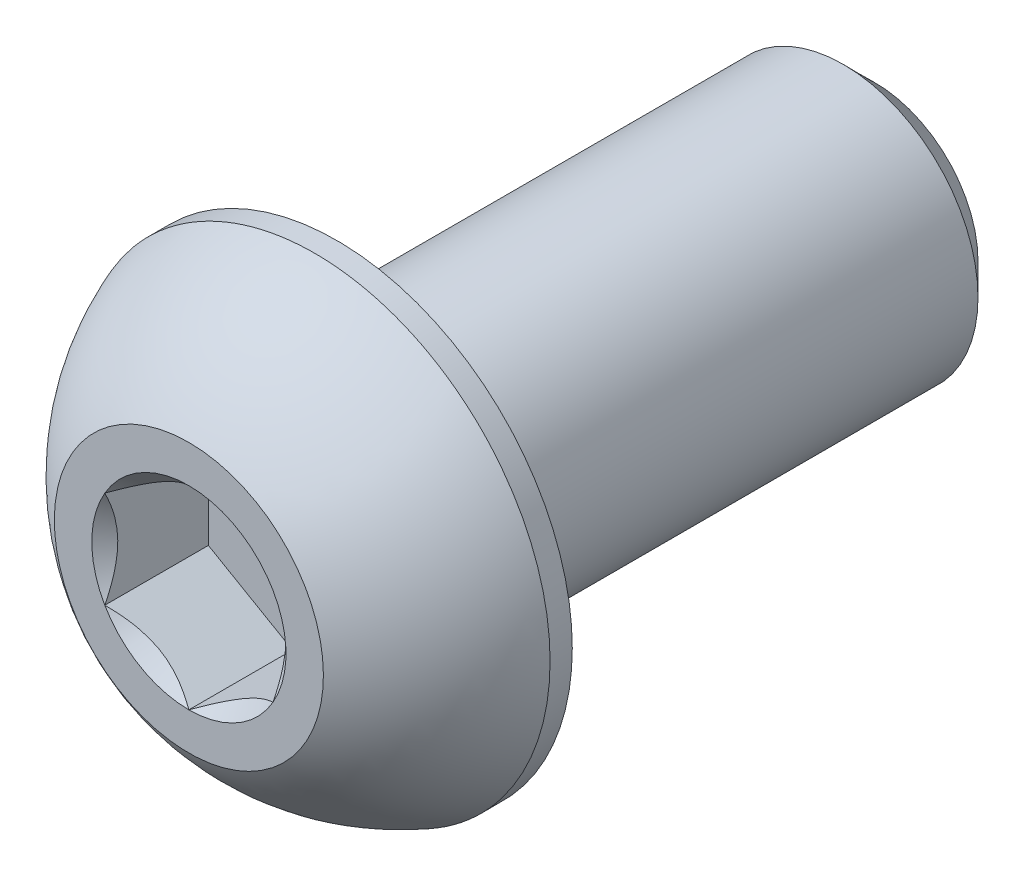
ISO-10303-21;
HEADER;
FILE_DESCRIPTION(('STEP AP214'),'2;1');
FILE_NAME('part.step','',(''),(''),'','','');
FILE_SCHEMA(('AUTOMOTIVE_DESIGN { 1 0 10303 214 1 1 1 1 }'));
ENDSEC;
DATA;
#1=APPLICATION_CONTEXT('core data for automotive mechanical design processes');
#2=APPLICATION_PROTOCOL_DEFINITION('international standard','automotive_design',2000,#1);
#3=PRODUCT_CONTEXT('',#1,'mechanical');
#4=PRODUCT('Part','Part','',(#3));
#5=PRODUCT_RELATED_PRODUCT_CATEGORY('part','',(#4));
#6=PRODUCT_DEFINITION_FORMATION('','',#4);
#7=PRODUCT_DEFINITION_CONTEXT('part definition',#1,'design');
#8=PRODUCT_DEFINITION('design','',#6,#7);
#9=PRODUCT_DEFINITION_SHAPE('','',#8);
#10=(LENGTH_UNIT() NAMED_UNIT(*) SI_UNIT(.MILLI.,.METRE.));
#11=(NAMED_UNIT(*) PLANE_ANGLE_UNIT() SI_UNIT($,.RADIAN.));
#12=(NAMED_UNIT(*) SI_UNIT($,.STERADIAN.) SOLID_ANGLE_UNIT());
#13=UNCERTAINTY_MEASURE_WITH_UNIT(LENGTH_MEASURE(1.E-05),#10,'distance_accuracy_value','');
#14=(GEOMETRIC_REPRESENTATION_CONTEXT(3) GLOBAL_UNCERTAINTY_ASSIGNED_CONTEXT((#13)) GLOBAL_UNIT_ASSIGNED_CONTEXT((#10,
#11,#12)) REPRESENTATION_CONTEXT('',''));
#15=CARTESIAN_POINT('',(0.,0.,0.));
#16=DIRECTION('',(0.,0.,1.));
#17=DIRECTION('',(1.,0.,0.));
#18=AXIS2_PLACEMENT_3D('',#15,#16,#17);
#19=CARTESIAN_POINT('',(2.5,-1.44337567297406,-3.08));
#20=DIRECTION('',(0.,0.,1.));
#21=DIRECTION('',(1.,0.,0.));
#22=AXIS2_PLACEMENT_3D('',#19,#20,#21);
#23=PLANE('',#22);
#24=DIRECTION('',(0.,1.,0.));
#25=VECTOR('',#24,1.);
#26=CARTESIAN_POINT('',(-2.5,1.44337567297406,-3.08));
#27=LINE('',#26,#25);
#28=CARTESIAN_POINT('',(-2.5,1.44337567297406,-3.08));
#29=VERTEX_POINT('',#28);
#30=CARTESIAN_POINT('',(-2.5,-1.44337567297407,-3.08));
#31=VERTEX_POINT('',#30);
#32=EDGE_CURVE('E67',#29,#31,#27,.F.);
#33=ORIENTED_EDGE('',*,*,#32,.T.);
#34=DIRECTION('',(0.866025403784439,-0.5,0.));
#35=VECTOR('',#34,1.);
#36=CARTESIAN_POINT('',(-2.5,-1.44337567297407,-3.08));
#37=LINE('',#36,#35);
#38=CARTESIAN_POINT('',(0.,-2.88675134594813,-3.08));
#39=VERTEX_POINT('',#38);
#40=EDGE_CURVE('E81',#31,#39,#37,.T.);
#41=ORIENTED_EDGE('',*,*,#40,.T.);
#42=DIRECTION('',(0.866025403784439,0.5,0.));
#43=VECTOR('',#42,1.);
#44=CARTESIAN_POINT('',(0.,-2.88675134594813,-3.08));
#45=LINE('',#44,#43);
#46=CARTESIAN_POINT('',(2.5,-1.44337567297407,-3.08));
#47=VERTEX_POINT('',#46);
#48=EDGE_CURVE('E84',#39,#47,#45,.T.);
#49=ORIENTED_EDGE('',*,*,#48,.T.);
#50=DIRECTION('',(0.,1.,0.));
#51=VECTOR('',#50,1.);
#52=CARTESIAN_POINT('',(2.5,-1.44337567297406,-3.08));
#53=LINE('',#52,#51);
#54=CARTESIAN_POINT('',(2.5,1.44337567297407,-3.08));
#55=VERTEX_POINT('',#54);
#56=EDGE_CURVE('E93',#47,#55,#53,.T.);
#57=ORIENTED_EDGE('',*,*,#56,.T.);
#58=DIRECTION('',(-0.866025403784439,0.5,0.));
#59=VECTOR('',#58,1.);
#60=CARTESIAN_POINT('',(2.5,1.44337567297407,-3.08));
#61=LINE('',#60,#59);
#62=CARTESIAN_POINT('',(0.,2.88675134594813,-3.08));
#63=VERTEX_POINT('',#62);
#64=EDGE_CURVE('E265',#55,#63,#61,.T.);
#65=ORIENTED_EDGE('',*,*,#64,.T.);
#66=DIRECTION('',(-0.866025403784438,-0.5,0.));
#67=VECTOR('',#66,1.);
#68=CARTESIAN_POINT('',(0.,2.88675134594813,-3.08));
#69=LINE('',#68,#67);
#70=EDGE_CURVE('E72',#63,#29,#69,.T.);
#71=ORIENTED_EDGE('',*,*,#70,.T.);
#72=EDGE_LOOP('',(#33,#41,#49,#57,#65,#71));
#73=FACE_BOUND('',#72,.T.);
#74=ADVANCED_FACE('F17',(#73),#23,.T.);
#75=CARTESIAN_POINT('',(-2.5,-1.44337567297407,-3.08));
#76=DIRECTION('',(-0.5,-0.866025403784439,0.));
#77=DIRECTION('',(0.866025403784439,-0.5,0.));
#78=AXIS2_PLACEMENT_3D('',#75,#76,#77);
#79=PLANE('',#78);
#80=CARTESIAN_POINT('',(-2.49999999998569,-1.44337567298233,-1.46396678585863E-11));
#81=CARTESIAN_POINT('',(-2.41407377904315,-1.49298519977395,-0.0495619175271006));
#82=CARTESIAN_POINT('',(-2.32671086992273,-1.54342419887182,-0.0962124995576485));
#83=CARTESIAN_POINT('',(-2.1485689328475,-1.64627449419617,-0.181627723729904));
#84=CARTESIAN_POINT('',(-2.05777297284226,-1.69869556614652,-0.220344856398487));
#85=CARTESIAN_POINT('',(-1.87468737311898,-1.8044000864315,-0.286667565165768));
#86=CARTESIAN_POINT('',(-1.78244433465153,-1.85765662952155,-0.314439795899311));
#87=CARTESIAN_POINT('',(-1.59592809137045,-1.96534183278812,-0.357228206963412));
#88=CARTESIAN_POINT('',(-1.5016605802636,-2.0197672057015,-0.372276315251622));
#89=CARTESIAN_POINT('',(-1.33918618210216,-2.11357184321643,-0.385853949513296));
#90=CARTESIAN_POINT('',(-1.27118904995568,-2.15283000576532,-0.387863271812533));
#91=CARTESIAN_POINT('',(-1.13530603994534,-2.23128209817308,-0.384473799764408));
#92=CARTESIAN_POINT('',(-1.0674202094257,-2.27047600069776,-0.379072408806146));
#93=CARTESIAN_POINT('',(-0.932289663221173,-2.34849365792468,-0.361168889112225));
#94=CARTESIAN_POINT('',(-0.865045749948768,-2.38731694935387,-0.348658821405654));
#95=CARTESIAN_POINT('',(-0.73172077243572,-2.46429216101073,-0.317224631812077));
#96=CARTESIAN_POINT('',(-0.665639619422681,-2.50244413249117,-0.298301001831163));
#97=CARTESIAN_POINT('',(-0.496416901916349,-2.60014491399645,-0.242135698828271));
#98=CARTESIAN_POINT('',(-0.394323538960074,-2.65908854458173,-0.200665028171538));
#99=CARTESIAN_POINT('',(-0.244203096433952,-2.74576062248505,-0.130658871896435));
#100=CARTESIAN_POINT('',(-0.194731548985054,-2.7743230337219,-0.106062244031806));
#101=CARTESIAN_POINT('',(-0.0967044691619815,-2.83091899464562,-0.0546271487293995));
#102=CARTESIAN_POINT('',(-0.0481483974597287,-2.85895285571371,-0.0277900552243485));
#103=CARTESIAN_POINT('',(-1.43136557881296E-11,-2.88675134593987,-1.46380702188117E-11));
#104=B_SPLINE_CURVE_WITH_KNOTS('',3,(#80,#81,#82,#83,#84,#85,#86,#87,#88,#89,#90,#91,#92,#93,
#94,#95,#96,#97,#98,#99,#100,#101,#102,#103),.UNSPECIFIED.,.F.,.F.,(4,2,2,2,2,2,2,2,2,2,2,4),
(0.,0.332957366447785,0.667853853657762,0.997433317025183,1.32618330924165,1.56147590693968,
1.79685096895087,2.03248941594701,2.26810979408197,2.64223182585016,2.82878537245759,
3.01522534654986),.UNSPECIFIED.);
#105=CARTESIAN_POINT('',(-2.49999999997815,-1.44337567296145,-3.16097570017431E-11));
#106=VERTEX_POINT('',#105);
#107=CARTESIAN_POINT('',(3.65479501188255E-11,-2.88675134591877,-3.57407377030047E-11));
#108=VERTEX_POINT('',#107);
#109=EDGE_CURVE('E20',#106,#108,#104,.T.);
#110=ORIENTED_EDGE('',*,*,#109,.T.);
#111=DIRECTION('',(0.,0.,1.));
#112=VECTOR('',#111,1.);
#113=CARTESIAN_POINT('',(0.,-2.88675134594813,-3.08));
#114=LINE('',#113,#112);
#115=EDGE_CURVE('E88',#108,#39,#114,.F.);
#116=ORIENTED_EDGE('',*,*,#115,.T.);
#117=ORIENTED_EDGE('',*,*,#40,.F.);
#118=DIRECTION('',(0.,0.,1.));
#119=VECTOR('',#118,1.);
#120=CARTESIAN_POINT('',(-2.5,-1.44337567297407,-3.08));
#121=LINE('',#120,#119);
#122=EDGE_CURVE('E59',#31,#106,#121,.T.);
#123=ORIENTED_EDGE('',*,*,#122,.T.);
#124=EDGE_LOOP('',(#110,#116,#117,#123));
#125=FACE_BOUND('',#124,.T.);
#126=ADVANCED_FACE('F89',(#125),#79,.F.);
#127=CARTESIAN_POINT('',(0.,-2.88675134594813,-3.08));
#128=DIRECTION('',(0.5,-0.866025403784439,0.));
#129=DIRECTION('',(0.866025403784439,0.5,0.));
#130=AXIS2_PLACEMENT_3D('',#127,#128,#129);
#131=PLANE('',#130);
#132=CARTESIAN_POINT('',(1.43122427161779E-11,-2.88675134593987,-1.46410621327117E-11));
#133=CARTESIAN_POINT('',(0.0859262209568495,-2.83714181914825,-0.0495619175271025));
#134=CARTESIAN_POINT('',(0.173289130077267,-2.78670282005038,-0.0962124995576506));
#135=CARTESIAN_POINT('',(0.351431067152504,-2.68385252472603,-0.181627723729906));
#136=CARTESIAN_POINT('',(0.442227027157743,-2.63143145277568,-0.22034485639849));
#137=CARTESIAN_POINT('',(0.625312626881024,-2.5257269324907,-0.28666756516577));
#138=CARTESIAN_POINT('',(0.717555665348469,-2.47247038940065,-0.314439795899313));
#139=CARTESIAN_POINT('',(0.904071908629556,-2.36478518613408,-0.357228206963415));
#140=CARTESIAN_POINT('',(0.998339419736406,-2.3103598132207,-0.372276315251625));
#141=CARTESIAN_POINT('',(1.16081381789785,-2.21655517570577,-0.385853949513299));
#142=CARTESIAN_POINT('',(1.22881095004432,-2.17729701315688,-0.387863271812536));
#143=CARTESIAN_POINT('',(1.36469396005466,-2.09884492074912,-0.384473799764411));
#144=CARTESIAN_POINT('',(1.43257979057431,-2.05965101822444,-0.379072408806149));
#145=CARTESIAN_POINT('',(1.56771033677883,-1.98163336099752,-0.361168889112229));
#146=CARTESIAN_POINT('',(1.63495425005123,-1.94281006956833,-0.348658821405657));
#147=CARTESIAN_POINT('',(1.76827922756428,-1.86583485791147,-0.317224631812081));
#148=CARTESIAN_POINT('',(1.83436038057732,-1.82768288643103,-0.298301001831167));
#149=CARTESIAN_POINT('',(2.00358309808365,-1.72998210492575,-0.242135698828275));
#150=CARTESIAN_POINT('',(2.10567646103993,-1.67103847434047,-0.200665028171542));
#151=CARTESIAN_POINT('',(2.25579690356605,-1.58436639643715,-0.130658871896439));
#152=CARTESIAN_POINT('',(2.30526845101495,-1.5558039852003,-0.10606224403181));
#153=CARTESIAN_POINT('',(2.40329553083802,-1.49920802427658,-0.0546271487294037));
#154=CARTESIAN_POINT('',(2.45185160254027,-1.47117416320849,-0.0277900552243527));
#155=CARTESIAN_POINT('',(2.49999999998569,-1.44337567298233,-1.46422604732884E-11));
#156=B_SPLINE_CURVE_WITH_KNOTS('',3,(#132,#133,#134,#135,#136,#137,#138,#139,#140,#141,#142,
#143,#144,#145,#146,#147,#148,#149,#150,#151,#152,#153,#154,#155),.UNSPECIFIED.,.F.,.F.,(4,2,2,
2,2,2,2,2,2,2,2,4),(0.,0.332957366447785,0.667853853657763,0.997433317025185,1.32618330924165,
1.56147590693968,1.79685096895087,2.03248941594701,2.26810979408197,2.64223182585016,
2.82878537245759,3.01522534654986),.UNSPECIFIED.);
#157=CARTESIAN_POINT('',(2.49999999999284,-1.44337567292773,-3.57428146410643E-11));
#158=VERTEX_POINT('',#157);
#159=EDGE_CURVE('E202',#108,#158,#156,.T.);
#160=ORIENTED_EDGE('',*,*,#159,.T.);
#161=DIRECTION('',(0.,0.,-1.));
#162=VECTOR('',#161,1.);
#163=CARTESIAN_POINT('',(2.5,-1.44337567297407,-3.08));
#164=LINE('',#163,#162);
#165=EDGE_CURVE('E97',#158,#47,#164,.T.);
#166=ORIENTED_EDGE('',*,*,#165,.T.);
#167=ORIENTED_EDGE('',*,*,#48,.F.);
#168=ORIENTED_EDGE('',*,*,#115,.F.);
#169=EDGE_LOOP('',(#160,#166,#167,#168));
#170=FACE_BOUND('',#169,.T.);
#171=ADVANCED_FACE('F95',(#170),#131,.F.);
#172=CARTESIAN_POINT('',(2.5,-1.44337567297406,-3.08));
#173=DIRECTION('',(1.,0.,0.));
#174=DIRECTION('',(0.,0.,-1.));
#175=AXIS2_PLACEMENT_3D('',#172,#173,#174);
#176=PLANE('',#175);
#177=CARTESIAN_POINT('',(2.5,-1.44337567295754,-1.46394821813904E-11));
#178=CARTESIAN_POINT('',(2.5,-1.3441566193743,-0.0495619175271012));
#179=CARTESIAN_POINT('',(2.5,-1.24327862117858,-0.0962124995576497));
#180=CARTESIAN_POINT('',(2.5,-1.03757803052988,-0.181627723729906));
#181=CARTESIAN_POINT('',(2.5,-0.932735886629165,-0.22034485639849));
#182=CARTESIAN_POINT('',(2.5,-0.721326846059205,-0.286667565165772));
#183=CARTESIAN_POINT('',(2.5,-0.614813759879106,-0.314439795899315));
#184=CARTESIAN_POINT('',(2.5,-0.399443353345959,-0.357228206963416));
#185=CARTESIAN_POINT('',(2.5,-0.290592607519207,-0.372276315251626));
#186=CARTESIAN_POINT('',(2.5,-0.102983332489348,-0.385853949513301));
#187=CARTESIAN_POINT('',(2.5,-0.024467007391568,-0.387863271812537));
#188=CARTESIAN_POINT('',(2.5,0.13243717742396,-0.384473799764412));
#189=CARTESIAN_POINT('',(2.5,0.210824982473321,-0.379072408806151));
#190=CARTESIAN_POINT('',(2.5,0.366860296927166,-0.36116888911223));
#191=CARTESIAN_POINT('',(2.5,0.444506879785539,-0.348658821405659));
#192=CARTESIAN_POINT('',(2.5,0.598457303099258,-0.317224631812082));
#193=CARTESIAN_POINT('',(2.5,0.674761246060135,-0.298301001831168));
#194=CARTESIAN_POINT('',(2.5,0.870162809070698,-0.242135698828276));
#195=CARTESIAN_POINT('',(2.5,0.988050070241258,-0.200665028171543));
#196=CARTESIAN_POINT('',(2.5,1.1613942260479,-0.130658871896439));
#197=CARTESIAN_POINT('',(2.5,1.2185190485216,-0.106062244031809));
#198=CARTESIAN_POINT('',(2.5,1.33171097036905,-0.0546271487294019));
#199=CARTESIAN_POINT('',(2.5,1.38777869250522,-0.0277900552243506));
#200=CARTESIAN_POINT('',(2.5,1.44337567295754,-1.46396590333616E-11));
#201=B_SPLINE_CURVE_WITH_KNOTS('',3,(#177,#178,#179,#180,#181,#182,#183,#184,#185,#186,#187,
#188,#189,#190,#191,#192,#193,#194,#195,#196,#197,#198,#199,#200),.UNSPECIFIED.,.F.,.F.,(4,2,2,
2,2,2,2,2,2,2,2,4),(0.,0.332957366447787,0.667853853657767,0.99743331702519,1.32618330924165,
1.56147590693969,1.79685096895088,2.03248941594702,2.26810979408198,2.64223182585017,
2.8287853724576,3.01522534654987),.UNSPECIFIED.);
#202=CARTESIAN_POINT('',(2.49999999995629,1.44337567299104,-3.57415206411453E-11));
#203=VERTEX_POINT('',#202);
#204=EDGE_CURVE('E184',#158,#203,#201,.T.);
#205=ORIENTED_EDGE('',*,*,#204,.T.);
#206=DIRECTION('',(0.,0.,1.));
#207=VECTOR('',#206,1.);
#208=CARTESIAN_POINT('',(2.5,1.44337567297407,-3.08));
#209=LINE('',#208,#207);
#210=EDGE_CURVE('E262',#203,#55,#209,.F.);
#211=ORIENTED_EDGE('',*,*,#210,.T.);
#212=ORIENTED_EDGE('',*,*,#56,.F.);
#213=ORIENTED_EDGE('',*,*,#165,.F.);
#214=EDGE_LOOP('',(#205,#211,#212,#213));
#215=FACE_BOUND('',#214,.T.);
#216=ADVANCED_FACE('F174',(#215),#176,.F.);
#217=CARTESIAN_POINT('',(2.5,1.44337567297407,-3.08));
#218=DIRECTION('',(0.5,0.866025403784439,0.));
#219=DIRECTION('',(-0.866025403784439,0.5,0.));
#220=AXIS2_PLACEMENT_3D('',#217,#218,#219);
#221=PLANE('',#220);
#222=CARTESIAN_POINT('',(2.49999999998569,1.44337567298233,-1.46397690507891E-11));
#223=CARTESIAN_POINT('',(2.41407377904315,1.49298519977395,-0.0495619175271006));
#224=CARTESIAN_POINT('',(2.32671086992273,1.54342419887182,-0.0962124995576485));
#225=CARTESIAN_POINT('',(2.1485689328475,1.64627449419617,-0.181627723729904));
#226=CARTESIAN_POINT('',(2.05777297284226,1.69869556614652,-0.220344856398487));
#227=CARTESIAN_POINT('',(1.87468737311898,1.8044000864315,-0.286667565165768));
#228=CARTESIAN_POINT('',(1.78244433465153,1.85765662952155,-0.314439795899311));
#229=CARTESIAN_POINT('',(1.59592809137045,1.96534183278812,-0.357228206963412));
#230=CARTESIAN_POINT('',(1.5016605802636,2.0197672057015,-0.372276315251622));
#231=CARTESIAN_POINT('',(1.33918618210216,2.11357184321643,-0.385853949513296));
#232=CARTESIAN_POINT('',(1.27118904995568,2.15283000576532,-0.387863271812533));
#233=CARTESIAN_POINT('',(1.13530603994534,2.23128209817308,-0.384473799764408));
#234=CARTESIAN_POINT('',(1.0674202094257,2.27047600069776,-0.379072408806146));
#235=CARTESIAN_POINT('',(0.932289663221173,2.34849365792468,-0.361168889112225));
#236=CARTESIAN_POINT('',(0.865045749948768,2.38731694935387,-0.348658821405654));
#237=CARTESIAN_POINT('',(0.73172077243572,2.46429216101073,-0.317224631812077));
#238=CARTESIAN_POINT('',(0.665639619422681,2.50244413249117,-0.298301001831163));
#239=CARTESIAN_POINT('',(0.496416901916349,2.60014491399645,-0.242135698828271));
#240=CARTESIAN_POINT('',(0.394323538960074,2.65908854458173,-0.200665028171538));
#241=CARTESIAN_POINT('',(0.244203096433952,2.74576062248505,-0.130658871896435));
#242=CARTESIAN_POINT('',(0.194731548985054,2.7743230337219,-0.106062244031806));
#243=CARTESIAN_POINT('',(0.0967044691619814,2.83091899464562,-0.0546271487293996));
#244=CARTESIAN_POINT('',(0.0481483974597285,2.85895285571371,-0.0277900552243486));
#245=CARTESIAN_POINT('',(1.4313665004019E-11,2.88675134593987,-1.4638073215738E-11));
#246=B_SPLINE_CURVE_WITH_KNOTS('',3,(#222,#223,#224,#225,#226,#227,#228,#229,#230,#231,#232,
#233,#234,#235,#236,#237,#238,#239,#240,#241,#242,#243,#244,#245),.UNSPECIFIED.,.F.,.F.,(4,2,2,
2,2,2,2,2,2,2,2,4),(0.,0.332957366447785,0.667853853657762,0.997433317025183,1.32618330924165,
1.56147590693968,1.79685096895087,2.03248941594701,2.26810979408197,2.64223182585016,
2.82878537245759,3.01522534654986),.UNSPECIFIED.);
#247=CARTESIAN_POINT('',(-3.65478449523691E-11,2.88675134591877,-3.57408260437138E-11));
#248=VERTEX_POINT('',#247);
#249=EDGE_CURVE('E178',#203,#248,#246,.T.);
#250=ORIENTED_EDGE('',*,*,#249,.T.);
#251=DIRECTION('',(0.,0.,1.));
#252=VECTOR('',#251,1.);
#253=CARTESIAN_POINT('',(0.,2.88675134594813,-3.08));
#254=LINE('',#253,#252);
#255=EDGE_CURVE('E257',#248,#63,#254,.F.);
#256=ORIENTED_EDGE('',*,*,#255,.T.);
#257=ORIENTED_EDGE('',*,*,#64,.F.);
#258=ORIENTED_EDGE('',*,*,#210,.F.);
#259=EDGE_LOOP('',(#250,#256,#257,#258));
#260=FACE_BOUND('',#259,.T.);
#261=ADVANCED_FACE('F170',(#260),#221,.F.);
#262=CARTESIAN_POINT('',(0.,2.88675134594813,-3.08));
#263=DIRECTION('',(-0.5,0.866025403784438,0.));
#264=DIRECTION('',(-0.866025403784438,-0.5,0.));
#265=AXIS2_PLACEMENT_3D('',#262,#263,#264);
#266=PLANE('',#265);
#267=CARTESIAN_POINT('',(-1.43122453357427E-11,2.88675134593987,-1.46408888183632E-11));
#268=CARTESIAN_POINT('',(-0.0859262209568495,2.83714181914825,-0.0495619175271024));
#269=CARTESIAN_POINT('',(-0.173289130077268,2.78670282005038,-0.0962124995576508));
#270=CARTESIAN_POINT('',(-0.351431067152505,2.68385252472603,-0.181627723729907));
#271=CARTESIAN_POINT('',(-0.442227027157744,2.63143145277568,-0.22034485639849));
#272=CARTESIAN_POINT('',(-0.625312626881025,2.5257269324907,-0.286667565165771));
#273=CARTESIAN_POINT('',(-0.717555665348471,2.47247038940065,-0.314439795899315));
#274=CARTESIAN_POINT('',(-0.904071908629558,2.36478518613408,-0.357228206963416));
#275=CARTESIAN_POINT('',(-0.998339419736408,2.3103598132207,-0.372276315251626));
#276=CARTESIAN_POINT('',(-1.16081381789785,2.21655517570577,-0.3858539495133));
#277=CARTESIAN_POINT('',(-1.22881095004432,2.17729701315688,-0.387863271812537));
#278=CARTESIAN_POINT('',(-1.36469396005466,2.09884492074912,-0.384473799764412));
#279=CARTESIAN_POINT('',(-1.43257979057431,2.05965101822444,-0.37907240880615));
#280=CARTESIAN_POINT('',(-1.56771033677883,1.98163336099751,-0.361168889112229));
#281=CARTESIAN_POINT('',(-1.63495425005123,1.94281006956833,-0.348658821405658));
#282=CARTESIAN_POINT('',(-1.76827922756428,1.86583485791147,-0.317224631812081));
#283=CARTESIAN_POINT('',(-1.83436038057732,1.82768288643103,-0.298301001831167));
#284=CARTESIAN_POINT('',(-2.00358309808365,1.72998210492575,-0.242135698828275));
#285=CARTESIAN_POINT('',(-2.10567646103993,1.67103847434047,-0.200665028171542));
#286=CARTESIAN_POINT('',(-2.25579690356605,1.58436639643715,-0.130658871896438));
#287=CARTESIAN_POINT('',(-2.30526845101495,1.5558039852003,-0.10606224403181));
#288=CARTESIAN_POINT('',(-2.40329553083802,1.49920802427657,-0.0546271487294029));
#289=CARTESIAN_POINT('',(-2.45185160254028,1.47117416320849,-0.0277900552243518));
#290=CARTESIAN_POINT('',(-2.49999999998569,1.44337567298233,-1.46406987167254E-11));
#291=B_SPLINE_CURVE_WITH_KNOTS('',3,(#267,#268,#269,#270,#271,#272,#273,#274,#275,#276,#277,
#278,#279,#280,#281,#282,#283,#284,#285,#286,#287,#288,#289,#290),.UNSPECIFIED.,.F.,.F.,(4,2,2,
2,2,2,2,2,2,2,2,4),(0.,0.332957366447787,0.667853853657765,0.997433317025187,1.32618330924165,
1.56147590693969,1.79685096895088,2.03248941594702,2.26810979408198,2.64223182585016,
2.82878537245759,3.01522534654986),.UNSPECIFIED.);
#292=CARTESIAN_POINT('',(-2.49999999999285,1.44337567292773,-3.57423066969592E-11));
#293=VERTEX_POINT('',#292);
#294=EDGE_CURVE('E40',#248,#293,#291,.T.);
#295=ORIENTED_EDGE('',*,*,#294,.T.);
#296=DIRECTION('',(0.,0.,1.));
#297=VECTOR('',#296,1.);
#298=CARTESIAN_POINT('',(-2.5,1.44337567297406,-3.08));
#299=LINE('',#298,#297);
#300=EDGE_CURVE('E250',#293,#29,#299,.F.);
#301=ORIENTED_EDGE('',*,*,#300,.T.);
#302=ORIENTED_EDGE('',*,*,#70,.F.);
#303=ORIENTED_EDGE('',*,*,#255,.F.);
#304=EDGE_LOOP('',(#295,#301,#302,#303));
#305=FACE_BOUND('',#304,.T.);
#306=ADVANCED_FACE('F163',(#305),#266,.F.);
#307=CARTESIAN_POINT('',(-2.5,1.44337567297406,-3.08));
#308=DIRECTION('',(-1.,0.,0.));
#309=DIRECTION('',(0.,0.,1.));
#310=AXIS2_PLACEMENT_3D('',#307,#308,#309);
#311=PLANE('',#310);
#312=CARTESIAN_POINT('',(-2.5,1.44337567295754,-1.46434148138432E-11));
#313=CARTESIAN_POINT('',(-2.5,1.34415661937429,-0.0495619175271046));
#314=CARTESIAN_POINT('',(-2.5,1.24327862117857,-0.0962124995576525));
#315=CARTESIAN_POINT('',(-2.5,1.03757803052987,-0.181627723729908));
#316=CARTESIAN_POINT('',(-2.5,0.932735886629161,-0.220344856398491));
#317=CARTESIAN_POINT('',(-2.5,0.721326846059201,-0.286667565165772));
#318=CARTESIAN_POINT('',(-2.5,0.614813759879103,-0.314439795899315));
#319=CARTESIAN_POINT('',(-2.5,0.399443353345957,-0.357228206963417));
#320=CARTESIAN_POINT('',(-2.5,0.290592607519206,-0.372276315251626));
#321=CARTESIAN_POINT('',(-2.5,0.102983332489346,-0.385853949513301));
#322=CARTESIAN_POINT('',(-2.5,0.0244670073915668,-0.387863271812537));
#323=CARTESIAN_POINT('',(-2.5,-0.132437177423961,-0.384473799764412));
#324=CARTESIAN_POINT('',(-2.5,-0.210824982473323,-0.379072408806151));
#325=CARTESIAN_POINT('',(-2.5,-0.366860296927167,-0.36116888911223));
#326=CARTESIAN_POINT('',(-2.5,-0.44450687978554,-0.348658821405659));
#327=CARTESIAN_POINT('',(-2.5,-0.598457303099258,-0.317224631812082));
#328=CARTESIAN_POINT('',(-2.5,-0.674761246060136,-0.298301001831168));
#329=CARTESIAN_POINT('',(-2.5,-0.870162809070698,-0.242135698828276));
#330=CARTESIAN_POINT('',(-2.5,-0.988050070241258,-0.200665028171542));
#331=CARTESIAN_POINT('',(-2.5,-1.1613942260479,-0.130658871896439));
#332=CARTESIAN_POINT('',(-2.5,-1.2185190485216,-0.10606224403181));
#333=CARTESIAN_POINT('',(-2.5,-1.33171097036905,-0.0546271487294023));
#334=CARTESIAN_POINT('',(-2.5,-1.38777869250522,-0.0277900552243509));
#335=CARTESIAN_POINT('',(-2.5,-1.44337567295754,-1.46396656675119E-11));
#336=B_SPLINE_CURVE_WITH_KNOTS('',3,(#312,#313,#314,#315,#316,#317,#318,#319,#320,#321,#322,
#323,#324,#325,#326,#327,#328,#329,#330,#331,#332,#333,#334,#335),.UNSPECIFIED.,.F.,.F.,(4,2,2,
2,2,2,2,2,2,2,2,4),(0.,0.332957366447785,0.667853853657762,0.997433317025184,1.32618330924165,
1.56147590693968,1.79685096895087,2.03248941594701,2.26810979408197,2.64223182585016,
2.82878537245759,3.01522534654986),.UNSPECIFIED.);
#337=EDGE_CURVE('E143',#293,#106,#336,.T.);
#338=ORIENTED_EDGE('',*,*,#337,.T.);
#339=ORIENTED_EDGE('',*,*,#122,.F.);
#340=ORIENTED_EDGE('',*,*,#32,.F.);
#341=ORIENTED_EDGE('',*,*,#300,.F.);
#342=EDGE_LOOP('',(#338,#339,#340,#341));
#343=FACE_BOUND('',#342,.T.);
#344=ADVANCED_FACE('F159',(#343),#311,.F.);
#345=CARTESIAN_POINT('',(0.,0.,-1.13686837721616E-10));
#346=DIRECTION('',(0.,0.,1.));
#347=DIRECTION('',(1.,0.,0.));
#348=AXIS2_PLACEMENT_3D('',#345,#346,#347);
#349=CONICAL_SURFACE('',#348,2.88675134584082,0.785398163397448);
#350=ORIENTED_EDGE('',*,*,#109,.F.);
#351=CARTESIAN_POINT('',(0.,0.,-5.6843418860808E-11));
#352=DIRECTION('',(0.,0.,1.));
#353=DIRECTION('',(1.,0.,0.));
#354=AXIS2_PLACEMENT_3D('',#351,#352,#353);
#355=CIRCLE('',#354,2.88675134589766);
#356=EDGE_CURVE('E151',#106,#108,#355,.T.);
#357=ORIENTED_EDGE('',*,*,#356,.T.);
#358=EDGE_LOOP('',(#350,#357));
#359=FACE_BOUND('',#358,.T.);
#360=ADVANCED_FACE('F162',(#359),#349,.F.);
#361=CARTESIAN_POINT('',(0.,0.,-1.13686837721616E-10));
#362=DIRECTION('',(0.,0.,1.));
#363=DIRECTION('',(1.,0.,0.));
#364=AXIS2_PLACEMENT_3D('',#361,#362,#363);
#365=CONICAL_SURFACE('',#364,2.88675134584082,0.785398163397448);
#366=ORIENTED_EDGE('',*,*,#159,.F.);
#367=CARTESIAN_POINT('',(0.,0.,-5.6843418860808E-11));
#368=DIRECTION('',(0.,0.,1.));
#369=DIRECTION('',(1.,0.,0.));
#370=AXIS2_PLACEMENT_3D('',#367,#368,#369);
#371=CIRCLE('',#370,2.88675134589766);
#372=EDGE_CURVE('E303',#108,#158,#371,.T.);
#373=ORIENTED_EDGE('',*,*,#372,.T.);
#374=EDGE_LOOP('',(#366,#373));
#375=FACE_BOUND('',#374,.T.);
#376=ADVANCED_FACE('F197',(#375),#365,.F.);
#377=CARTESIAN_POINT('',(0.,0.,-1.13686837721616E-10));
#378=DIRECTION('',(0.,0.,1.));
#379=DIRECTION('',(1.,0.,0.));
#380=AXIS2_PLACEMENT_3D('',#377,#378,#379);
#381=CONICAL_SURFACE('',#380,2.88675134584082,0.785398163397448);
#382=CARTESIAN_POINT('',(0.,0.,-5.6843418860808E-11));
#383=DIRECTION('',(0.,0.,1.));
#384=DIRECTION('',(1.,0.,0.));
#385=AXIS2_PLACEMENT_3D('',#382,#383,#384);
#386=CIRCLE('',#385,2.88675134589766);
#387=EDGE_CURVE('E304',#158,#203,#386,.T.);
#388=ORIENTED_EDGE('',*,*,#387,.T.);
#389=ORIENTED_EDGE('',*,*,#204,.F.);
#390=EDGE_LOOP('',(#388,#389));
#391=FACE_BOUND('',#390,.T.);
#392=ADVANCED_FACE('F193',(#391),#381,.F.);
#393=CARTESIAN_POINT('',(0.,0.,-1.13686837721616E-10));
#394=DIRECTION('',(0.,0.,1.));
#395=DIRECTION('',(1.,0.,0.));
#396=AXIS2_PLACEMENT_3D('',#393,#394,#395);
#397=CONICAL_SURFACE('',#396,2.88675134584082,0.785398163397448);
#398=ORIENTED_EDGE('',*,*,#249,.F.);
#399=CARTESIAN_POINT('',(0.,0.,-5.6843418860808E-11));
#400=DIRECTION('',(0.,0.,1.));
#401=DIRECTION('',(1.,0.,0.));
#402=AXIS2_PLACEMENT_3D('',#399,#400,#401);
#403=CIRCLE('',#402,2.88675134589766);
#404=EDGE_CURVE('E305',#203,#248,#403,.T.);
#405=ORIENTED_EDGE('',*,*,#404,.T.);
#406=EDGE_LOOP('',(#398,#405));
#407=FACE_BOUND('',#406,.T.);
#408=ADVANCED_FACE('F190',(#407),#397,.F.);
#409=CARTESIAN_POINT('',(0.,0.,-1.13686837721616E-10));
#410=DIRECTION('',(0.,0.,1.));
#411=DIRECTION('',(1.,0.,0.));
#412=AXIS2_PLACEMENT_3D('',#409,#410,#411);
#413=CONICAL_SURFACE('',#412,2.88675134584082,0.785398163397448);
#414=ORIENTED_EDGE('',*,*,#294,.F.);
#415=CARTESIAN_POINT('',(0.,0.,-5.6843852541677E-11));
#416=DIRECTION('',(0.,0.,1.));
#417=DIRECTION('',(1.,0.,0.));
#418=AXIS2_PLACEMENT_3D('',#415,#416,#417);
#419=CIRCLE('',#418,2.88675134589766);
#420=EDGE_CURVE('E298',#248,#293,#419,.T.);
#421=ORIENTED_EDGE('',*,*,#420,.T.);
#422=EDGE_LOOP('',(#414,#421));
#423=FACE_BOUND('',#422,.T.);
#424=ADVANCED_FACE('F138',(#423),#413,.F.);
#425=CARTESIAN_POINT('',(0.,0.,-1.13686837721616E-10));
#426=DIRECTION('',(0.,0.,1.));
#427=DIRECTION('',(1.,0.,0.));
#428=AXIS2_PLACEMENT_3D('',#425,#426,#427);
#429=CONICAL_SURFACE('',#428,2.88675134584082,0.785398163397448);
#430=ORIENTED_EDGE('',*,*,#337,.F.);
#431=CARTESIAN_POINT('',(0.,0.,-5.6843418860808E-11));
#432=DIRECTION('',(0.,0.,1.));
#433=DIRECTION('',(1.,0.,0.));
#434=AXIS2_PLACEMENT_3D('',#431,#432,#433);
#435=CIRCLE('',#434,2.88675134589766);
#436=EDGE_CURVE('E123',#293,#106,#435,.T.);
#437=ORIENTED_EDGE('',*,*,#436,.T.);
#438=EDGE_LOOP('',(#430,#437));
#439=FACE_BOUND('',#438,.T.);
#440=ADVANCED_FACE('F133',(#439),#429,.F.);
#441=CARTESIAN_POINT('',(0.,-4.,0.));
#442=DIRECTION('',(0.,0.,-1.));
#443=DIRECTION('',(-1.,0.,0.));
#444=AXIS2_PLACEMENT_3D('',#441,#442,#443);
#445=PLANE('',#444);
#446=ORIENTED_EDGE('',*,*,#420,.F.);
#447=ORIENTED_EDGE('',*,*,#404,.F.);
#448=ORIENTED_EDGE('',*,*,#387,.F.);
#449=ORIENTED_EDGE('',*,*,#372,.F.);
#450=ORIENTED_EDGE('',*,*,#356,.F.);
#451=ORIENTED_EDGE('',*,*,#436,.F.);
#452=EDGE_LOOP('',(#446,#447,#448,#449,#450,#451));
#453=FACE_BOUND('',#452,.T.);
#454=CARTESIAN_POINT('',(0.,4.,0.));
#455=CARTESIAN_POINT('',(-0.224681767866064,3.99999003661802,0.));
#456=CARTESIAN_POINT('',(-0.44952645118768,3.98100576774657,0.));
#457=CARTESIAN_POINT('',(-0.893023453588252,3.90553719844645,0.));
#458=CARTESIAN_POINT('',(-1.11166798922422,3.84900776494288,0.));
#459=CARTESIAN_POINT('',(-1.53627539609881,3.7000581283699,0.));
#460=CARTESIAN_POINT('',(-1.74224426964141,3.60765506641117,0.));
#461=CARTESIAN_POINT('',(-2.1356876194499,3.38960470170983,0.));
#462=CARTESIAN_POINT('',(-2.3231666785736,3.26396566535879,0.));
#463=CARTESIAN_POINT('',(-2.67439419660806,2.98298441438641,0.));
#464=CARTESIAN_POINT('',(-2.83814017027714,2.82763909297665,0.));
#465=CARTESIAN_POINT('',(-3.13723374355398,2.49165659254895,0.));
#466=CARTESIAN_POINT('',(-3.27258022796354,2.31101842078932,0.));
#467=CARTESIAN_POINT('',(-3.51102281676964,1.92958645723378,0.));
#468=CARTESIAN_POINT('',(-3.61411952175977,1.72879304088472,0.));
#469=CARTESIAN_POINT('',(-3.78513904681604,1.31274812032901,0.));
#470=CARTESIAN_POINT('',(-3.85306193760967,1.09749664519561,0.));
#471=CARTESIAN_POINT('',(-3.95180615221404,0.658645177224103,0.));
#472=CARTESIAN_POINT('',(-3.98262740529569,0.435045168471534,0.));
#473=CARTESIAN_POINT('',(-4.00629315051677,-0.0141552150190058,0.));
#474=CARTESIAN_POINT('',(-3.99913771108643,-0.239755586151791,0.));
#475=CARTESIAN_POINT('',(-3.94705334477136,-0.686553057770751,0.));
#476=CARTESIAN_POINT('',(-3.90212440379158,-0.907750156613828,0.));
#477=CARTESIAN_POINT('',(-3.77576834682868,-1.33946209637274,0.));
#478=CARTESIAN_POINT('',(-3.69434119231779,-1.54997692601204,0.));
#479=CARTESIAN_POINT('',(-3.4973002104411,-1.9543481065904,0.));
#480=CARTESIAN_POINT('',(-3.38168639420037,-2.14820446295046,0.));
#481=CARTESIAN_POINT('',(-3.11955406993027,-2.51375568569415,0.));
#482=CARTESIAN_POINT('',(-2.9730355744101,-2.68545056104797,0.));
#483=CARTESIAN_POINT('',(-2.6532530690147,-3.00180502498552,0.));
#484=CARTESIAN_POINT('',(-2.47998905547423,-3.14646460986429,0.));
#485=CARTESIAN_POINT('',(-2.11163395980963,-3.40464202073756,0.));
#486=CARTESIAN_POINT('',(-1.91654287483308,-3.51815984266236,0.));
#487=CARTESIAN_POINT('',(-1.51007172649934,-3.71083126079983,0.));
#488=CARTESIAN_POINT('',(-1.29869166383959,-3.78998485848384,0.));
#489=CARTESIAN_POINT('',(-0.865643021338382,-3.91168089449035,0.));
#490=CARTESIAN_POINT('',(-0.643974441960438,-3.9542233344622,0.));
#491=CARTESIAN_POINT('',(-0.196641276119309,-4.00148940636231,0.));
#492=CARTESIAN_POINT('',(0.0290233103438769,-4.00621303829057,0.));
#493=CARTESIAN_POINT('',(0.47794254665863,-3.9777074034369,0.));
#494=CARTESIAN_POINT('',(0.701197196401627,-3.94447813494516,0.));
#495=CARTESIAN_POINT('',(1.13895901494602,-3.84100997549715,0.));
#496=CARTESIAN_POINT('',(1.35346618337288,-3.77077108295628,0.));
#497=CARTESIAN_POINT('',(1.76764377335729,-3.59527756187357,0.));
#498=CARTESIAN_POINT('',(1.96731419685375,-3.49002293790771,0.));
#499=CARTESIAN_POINT('',(2.34615024642941,-3.24748583733941,0.));
#500=CARTESIAN_POINT('',(2.52531587531863,-3.11020336512612,0.));
#501=CARTESIAN_POINT('',(2.85805645153243,-2.80750754285968,0.));
#502=CARTESIAN_POINT('',(3.01163138849874,-2.64209418142011,0.));
#503=CARTESIAN_POINT('',(3.28883099510813,-2.28783216212243,0.));
#504=CARTESIAN_POINT('',(3.41245565500475,-2.09898349663801,0.));
#505=CARTESIAN_POINT('',(3.62624518497479,-1.7032119856158,0.));
#506=CARTESIAN_POINT('',(3.71641009036852,-1.49628915915748,0.));
#507=CARTESIAN_POINT('',(3.86072075559837,-1.07024315957474,0.));
#508=CARTESIAN_POINT('',(3.91486652887491,-0.85111999100287,0.));
#509=CARTESIAN_POINT('',(3.98560200790484,-0.406893084983746,0.));
#510=CARTESIAN_POINT('',(4.00219164598566,-0.1817893367608,0.));
#511=CARTESIAN_POINT('',(3.99734373828825,0.268007871600404,0.));
#512=CARTESIAN_POINT('',(3.97590626500321,0.492701332519999,0.));
#513=CARTESIAN_POINT('',(3.89561270203183,0.935300471262992,0.));
#514=CARTESIAN_POINT('',(3.83675653710378,1.15320613543653,0.));
#515=CARTESIAN_POINT('',(3.68329498873635,1.57604743444959,0.));
#516=CARTESIAN_POINT('',(3.58868893950105,1.7809828276514,0.));
#517=CARTESIAN_POINT('',(3.36641721444657,2.17205377570362,0.));
#518=CARTESIAN_POINT('',(3.23875283667302,2.3581900683078,0.));
#519=CARTESIAN_POINT('',(2.95400366555079,2.70636982413495,0.));
#520=CARTESIAN_POINT('',(2.79692195185322,2.8684158061492,0.));
#521=CARTESIAN_POINT('',(2.4577372134781,3.16387704609162,0.));
#522=CARTESIAN_POINT('',(2.27562797954534,3.29728517794338,0.));
#523=CARTESIAN_POINT('',(1.89152596104929,3.53168458834208,0.));
#524=CARTESIAN_POINT('',(1.68952372439702,3.63266035871883,0.));
#525=CARTESIAN_POINT('',(1.27159238909409,3.79914908224813,0.));
#526=CARTESIAN_POINT('',(1.05568033439538,3.86470454516587,0.));
#527=CARTESIAN_POINT('',(0.698660219581013,3.9410197788314,0.));
#528=CARTESIAN_POINT('',(0.559871996412004,3.96310975859038,0.));
#529=CARTESIAN_POINT('',(0.280743721667739,3.99260298223412,0.));
#530=CARTESIAN_POINT('',(0.140403670092482,4.00000622611888,0.));
#531=CARTESIAN_POINT('',(0.,4.,0.));
#532=B_SPLINE_CURVE_WITH_KNOTS('',3,(#454,#455,#456,#457,#458,#459,#460,#461,#462,#463,#464,
#465,#466,#467,#468,#469,#470,#471,#472,#473,#474,#475,#476,#477,#478,#479,#480,#481,#482,#483,
#484,#485,#486,#487,#488,#489,#490,#491,#492,#493,#494,#495,#496,#497,#498,#499,#500,#501,#502,
#503,#504,#505,#506,#507,#508,#509,#510,#511,#512,#513,#514,#515,#516,#517,#518,#519,#520,#521,
#522,#523,#524,#525,#526,#527,#528,#529,#530,#531),.UNSPECIFIED.,.T.,.F.,(4,2,2,2,2,2,2,2,2,2,2,
2,2,2,2,2,2,2,2,2,2,2,2,2,2,2,2,2,2,2,2,2,2,2,2,2,2,2,4),(0.,0.673532830496008,1.34787678436072,
2.02189891947998,2.69575357039147,3.36967873398818,4.04363035649473,4.71756942712821,
5.39150714259986,6.06544614283765,6.73938392870497,7.41332196604991,8.0872607148101,
8.76119924425644,9.43513750091522,10.1090758499316,10.7830142870203,11.4569526952537,
12.1308910731255,12.8048294509973,13.4787678592306,14.1527062963194,14.8266446453357,
15.5005829019945,16.1745214314408,16.848460180201,17.522398217546,18.1963360034133,
18.8702750036511,19.5442127191227,20.2181517897562,20.8921034122628,21.5660285758595,
22.2398832267709,22.9139053618902,23.5882493157549,24.2617821462509,24.6826729120109,
25.1035636777709),.UNSPECIFIED.);
#533=CARTESIAN_POINT('',(0.,4.,0.));
#534=VERTEX_POINT('',#533);
#535=EDGE_CURVE('E115',#534,#534,#532,.F.);
#536=ORIENTED_EDGE('',*,*,#535,.F.);
#537=EDGE_LOOP('',(#536));
#538=FACE_BOUND('',#537,.T.);
#539=ADVANCED_FACE('F129',(#453,#538),#445,.F.);
#540=CARTESIAN_POINT('',(0.,0.,-6.28176470588235));
#541=DIRECTION('',(0.,-1.,0.));
#542=DIRECTION('',(0.,0.,-1.));
#543=AXIS2_PLACEMENT_3D('',#540,#541,#542);
#544=SPHERICAL_SURFACE('',#543,7.44718522799515);
#545=ORIENTED_EDGE('',*,*,#535,.T.);
#546=EDGE_LOOP('',(#545));
#547=FACE_BOUND('',#546,.T.);
#548=CARTESIAN_POINT('',(0.,0.,-3.74));
#549=DIRECTION('',(0.,0.,1.));
#550=DIRECTION('',(1.,0.,0.));
#551=AXIS2_PLACEMENT_3D('',#548,#549,#550);
#552=CIRCLE('',#551,7.);
#553=CARTESIAN_POINT('',(7.,0.,-3.74));
#554=VERTEX_POINT('',#553);
#555=EDGE_CURVE('E112',#554,#554,#552,.F.);
#556=ORIENTED_EDGE('',*,*,#555,.F.);
#557=EDGE_LOOP('',(#556));
#558=FACE_BOUND('',#557,.T.);
#559=ADVANCED_FACE('F125',(#547,#558),#544,.T.);
#560=CARTESIAN_POINT('',(0.,-4.,-20.4));
#561=DIRECTION('',(0.,0.,-1.));
#562=DIRECTION('',(-1.,0.,0.));
#563=AXIS2_PLACEMENT_3D('',#560,#561,#562);
#564=PLANE('',#563);
#565=CARTESIAN_POINT('',(0.,0.,-20.3999999999951));
#566=DIRECTION('',(0.,0.,1.));
#567=DIRECTION('',(1.,0.,0.));
#568=AXIS2_PLACEMENT_3D('',#565,#566,#567);
#569=CIRCLE('',#568,3.06249999994179);
#570=CARTESIAN_POINT('',(3.06249999994179,0.,-20.3999999999951));
#571=VERTEX_POINT('',#570);
#572=EDGE_CURVE('E109',#571,#571,#569,.T.);
#573=ORIENTED_EDGE('',*,*,#572,.F.);
#574=EDGE_LOOP('',(#573));
#575=FACE_BOUND('',#574,.T.);
#576=ADVANCED_FACE('F233',(#575),#564,.T.);
#577=CARTESIAN_POINT('',(0.,0.,0.));
#578=DIRECTION('',(0.,0.,1.));
#579=DIRECTION('',(1.,0.,0.));
#580=AXIS2_PLACEMENT_3D('',#577,#578,#579);
#581=CYLINDRICAL_SURFACE('',#580,7.);
#582=CARTESIAN_POINT('',(0.,0.,-4.4));
#583=DIRECTION('',(0.,0.,1.));
#584=DIRECTION('',(1.,0.,0.));
#585=AXIS2_PLACEMENT_3D('',#582,#583,#584);
#586=CIRCLE('',#585,7.);
#587=CARTESIAN_POINT('',(7.,0.,-4.4));
#588=VERTEX_POINT('',#587);
#589=EDGE_CURVE('E106',#588,#588,#586,.T.);
#590=ORIENTED_EDGE('',*,*,#589,.T.);
#591=EDGE_LOOP('',(#590));
#592=FACE_BOUND('',#591,.T.);
#593=ORIENTED_EDGE('',*,*,#555,.T.);
#594=EDGE_LOOP('',(#593));
#595=FACE_BOUND('',#594,.T.);
#596=ADVANCED_FACE('F230',(#592,#595),#581,.T.);
#597=CARTESIAN_POINT('',(0.,0.,-19.4624999999746));
#598=DIRECTION('',(0.,0.,1.));
#599=DIRECTION('',(1.,0.,0.));
#600=AXIS2_PLACEMENT_3D('',#597,#598,#599);
#601=CONICAL_SURFACE('',#600,3.99999999996226,0.785398163397448);
#602=ORIENTED_EDGE('',*,*,#572,.T.);
#603=EDGE_LOOP('',(#602));
#604=FACE_BOUND('',#603,.T.);
#605=CARTESIAN_POINT('',(0.,0.,-19.4625));
#606=DIRECTION('',(0.,0.,-1.));
#607=DIRECTION('',(-1.,0.,0.));
#608=AXIS2_PLACEMENT_3D('',#605,#606,#607);
#609=CIRCLE('',#608,4.);
#610=CARTESIAN_POINT('',(-4.,0.,-19.4625));
#611=VERTEX_POINT('',#610);
#612=EDGE_CURVE('E31',#611,#611,#609,.F.);
#613=ORIENTED_EDGE('',*,*,#612,.F.);
#614=EDGE_LOOP('',(#613));
#615=FACE_BOUND('',#614,.T.);
#616=ADVANCED_FACE('F223',(#604,#615),#601,.T.);
#617=CARTESIAN_POINT('',(0.,-7.,-4.4));
#618=DIRECTION('',(0.,0.,1.));
#619=DIRECTION('',(1.,0.,0.));
#620=AXIS2_PLACEMENT_3D('',#617,#618,#619);
#621=PLANE('',#620);
#622=CARTESIAN_POINT('',(0.,0.,-4.4));
#623=DIRECTION('',(0.,0.,-1.));
#624=DIRECTION('',(-1.,0.,0.));
#625=AXIS2_PLACEMENT_3D('',#622,#623,#624);
#626=CIRCLE('',#625,4.);
#627=CARTESIAN_POINT('',(-4.,0.,-4.4));
#628=VERTEX_POINT('',#627);
#629=EDGE_CURVE('E11',#628,#628,#626,.T.);
#630=ORIENTED_EDGE('',*,*,#629,.F.);
#631=EDGE_LOOP('',(#630));
#632=FACE_BOUND('',#631,.T.);
#633=ORIENTED_EDGE('',*,*,#589,.F.);
#634=EDGE_LOOP('',(#633));
#635=FACE_BOUND('',#634,.T.);
#636=ADVANCED_FACE('F217',(#632,#635),#621,.F.);
#637=CARTESIAN_POINT('',(0.,0.,-20.4));
#638=DIRECTION('',(0.,0.,-1.));
#639=DIRECTION('',(-1.,0.,0.));
#640=AXIS2_PLACEMENT_3D('',#637,#638,#639);
#641=CYLINDRICAL_SURFACE('',#640,4.);
#642=ORIENTED_EDGE('',*,*,#629,.T.);
#643=EDGE_LOOP('',(#642));
#644=FACE_BOUND('',#643,.T.);
#645=ORIENTED_EDGE('',*,*,#612,.T.);
#646=EDGE_LOOP('',(#645));
#647=FACE_BOUND('',#646,.T.);
#648=ADVANCED_FACE('F215',(#644,#647),#641,.T.);
#649=CLOSED_SHELL('',(#74,#126,#171,#216,#261,#306,#344,#360,#376,#392,#408,#424,#440,#539,#559,
#576,#596,#616,#636,#648));
#650=MANIFOLD_SOLID_BREP('B1',#649);
#651=ADVANCED_BREP_SHAPE_REPRESENTATION('',(#18,#650),#14);
#652=SHAPE_DEFINITION_REPRESENTATION(#9,#651);
ENDSEC;
END-ISO-10303-21;
